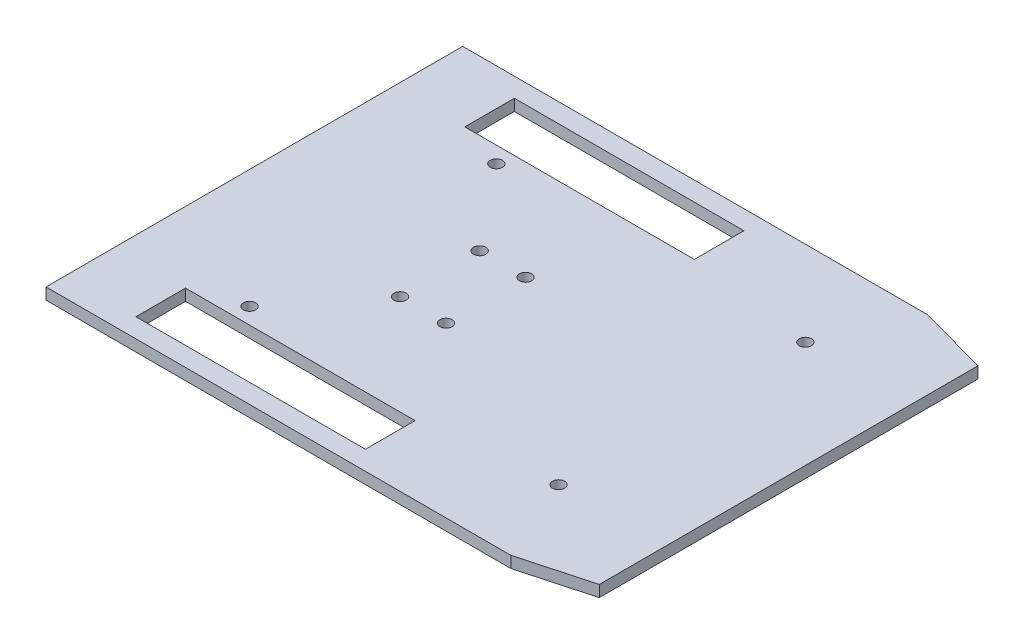
ISO-10303-21;
HEADER;
FILE_DESCRIPTION(('STEP AP214'),'2;1');
FILE_NAME('part.step','',(''),(''),'','','');
FILE_SCHEMA(('AUTOMOTIVE_DESIGN { 1 0 10303 214 1 1 1 1 }'));
ENDSEC;
DATA;
#1=APPLICATION_CONTEXT('core data for automotive mechanical design processes');
#2=APPLICATION_PROTOCOL_DEFINITION('international standard','automotive_design',2000,#1);
#3=PRODUCT_CONTEXT('',#1,'mechanical');
#4=PRODUCT('Part','Part','',(#3));
#5=PRODUCT_RELATED_PRODUCT_CATEGORY('part','',(#4));
#6=PRODUCT_DEFINITION_FORMATION('','',#4);
#7=PRODUCT_DEFINITION_CONTEXT('part definition',#1,'design');
#8=PRODUCT_DEFINITION('design','',#6,#7);
#9=PRODUCT_DEFINITION_SHAPE('','',#8);
#10=(LENGTH_UNIT() NAMED_UNIT(*) SI_UNIT(.MILLI.,.METRE.));
#11=(NAMED_UNIT(*) PLANE_ANGLE_UNIT() SI_UNIT($,.RADIAN.));
#12=(NAMED_UNIT(*) SI_UNIT($,.STERADIAN.) SOLID_ANGLE_UNIT());
#13=UNCERTAINTY_MEASURE_WITH_UNIT(LENGTH_MEASURE(1.E-05),#10,'distance_accuracy_value','');
#14=(GEOMETRIC_REPRESENTATION_CONTEXT(3) GLOBAL_UNCERTAINTY_ASSIGNED_CONTEXT((#13)) GLOBAL_UNIT_ASSIGNED_CONTEXT((#10,
#11,#12)) REPRESENTATION_CONTEXT('',''));
#15=CARTESIAN_POINT('',(0.,0.,0.));
#16=DIRECTION('',(0.,0.,1.));
#17=DIRECTION('',(1.,0.,0.));
#18=AXIS2_PLACEMENT_3D('',#15,#16,#17);
#19=CARTESIAN_POINT('',(0.,3.,0.));
#20=DIRECTION('',(0.,-1.,0.));
#21=DIRECTION('',(0.,0.,-1.));
#22=AXIS2_PLACEMENT_3D('',#19,#20,#21);
#23=PLANE('',#22);
#24=DIRECTION('',(1.,0.,0.));
#25=VECTOR('',#24,1.);
#26=CARTESIAN_POINT('',(9.99999999999999,3.,4.46609098685543));
#27=LINE('',#26,#25);
#28=CARTESIAN_POINT('',(9.99999999999999,3.,4.46609098685543));
#29=VERTEX_POINT('',#28);
#30=CARTESIAN_POINT('',(70.,3.,4.46609098685543));
#31=VERTEX_POINT('',#30);
#32=EDGE_CURVE('E159',#29,#31,#27,.T.);
#33=ORIENTED_EDGE('',*,*,#32,.F.);
#34=DIRECTION('',(0.,0.,-1.));
#35=VECTOR('',#34,1.);
#36=CARTESIAN_POINT('',(9.99999999999999,3.,0.));
#37=LINE('',#36,#35);
#38=CARTESIAN_POINT('',(9.99999999999999,3.,-8.50000000000003));
#39=VERTEX_POINT('',#38);
#40=EDGE_CURVE('E251',#29,#39,#37,.T.);
#41=ORIENTED_EDGE('',*,*,#40,.T.);
#42=DIRECTION('',(1.,0.,0.));
#43=VECTOR('',#42,1.);
#44=CARTESIAN_POINT('',(0.,3.,-8.50000000000004));
#45=LINE('',#44,#43);
#46=CARTESIAN_POINT('',(70.,3.,-8.50000000000001));
#47=VERTEX_POINT('',#46);
#48=EDGE_CURVE('E248',#39,#47,#45,.T.);
#49=ORIENTED_EDGE('',*,*,#48,.T.);
#50=DIRECTION('',(0.,0.,1.));
#51=VECTOR('',#50,1.);
#52=CARTESIAN_POINT('',(70.,3.,1.14287664299648E-13));
#53=LINE('',#52,#51);
#54=EDGE_CURVE('E254',#47,#31,#53,.T.);
#55=ORIENTED_EDGE('',*,*,#54,.T.);
#56=EDGE_LOOP('',(#33,#41,#49,#55));
#57=FACE_BOUND('',#56,.T.);
#58=CARTESIAN_POINT('',(103.27,3.,-77.26));
#59=DIRECTION('',(0.,1.,0.));
#60=DIRECTION('',(0.,0.,1.));
#61=AXIS2_PLACEMENT_3D('',#58,#59,#60);
#62=CIRCLE('',#61,1.60000000000001);
#63=CARTESIAN_POINT('',(103.27,3.,-75.66));
#64=VERTEX_POINT('',#63);
#65=EDGE_CURVE('E217',#64,#64,#62,.F.);
#66=ORIENTED_EDGE('',*,*,#65,.T.);
#67=EDGE_LOOP('',(#66));
#68=FACE_BOUND('',#67,.T.);
#69=CARTESIAN_POINT('',(22.5,3.,-12.74));
#70=DIRECTION('',(0.,1.,0.));
#71=DIRECTION('',(0.,0.,1.));
#72=AXIS2_PLACEMENT_3D('',#69,#70,#71);
#73=CIRCLE('',#72,1.6);
#74=CARTESIAN_POINT('',(22.5,3.,-11.14));
#75=VERTEX_POINT('',#74);
#76=EDGE_CURVE('E228',#75,#75,#73,.T.);
#77=ORIENTED_EDGE('',*,*,#76,.F.);
#78=EDGE_LOOP('',(#77));
#79=FACE_BOUND('',#78,.T.);
#80=CARTESIAN_POINT('',(22.5,3.,-77.26));
#81=DIRECTION('',(0.,1.,0.));
#82=DIRECTION('',(0.,0.,1.));
#83=AXIS2_PLACEMENT_3D('',#80,#81,#82);
#84=CIRCLE('',#83,1.60000000000001);
#85=CARTESIAN_POINT('',(22.5,3.,-75.66));
#86=VERTEX_POINT('',#85);
#87=EDGE_CURVE('E231',#86,#86,#84,.F.);
#88=ORIENTED_EDGE('',*,*,#87,.T.);
#89=EDGE_LOOP('',(#88));
#90=FACE_BOUND('',#89,.T.);
#91=CARTESIAN_POINT('',(40.,3.,-34.6));
#92=DIRECTION('',(0.,1.,0.));
#93=DIRECTION('',(0.,0.,1.));
#94=AXIS2_PLACEMENT_3D('',#91,#92,#93);
#95=CIRCLE('',#94,1.60000000000001);
#96=CARTESIAN_POINT('',(40.,3.,-33.));
#97=VERTEX_POINT('',#96);
#98=EDGE_CURVE('E243',#97,#97,#95,.F.);
#99=ORIENTED_EDGE('',*,*,#98,.T.);
#100=EDGE_LOOP('',(#99));
#101=FACE_BOUND('',#100,.T.);
#102=CARTESIAN_POINT('',(52.,3.,-34.6));
#103=DIRECTION('',(0.,1.,0.));
#104=DIRECTION('',(0.,0.,1.));
#105=AXIS2_PLACEMENT_3D('',#102,#103,#104);
#106=CIRCLE('',#105,1.60000000000001);
#107=CARTESIAN_POINT('',(52.,3.,-33.));
#108=VERTEX_POINT('',#107);
#109=EDGE_CURVE('E244',#108,#108,#106,.F.);
#110=ORIENTED_EDGE('',*,*,#109,.T.);
#111=EDGE_LOOP('',(#110));
#112=FACE_BOUND('',#111,.T.);
#113=CARTESIAN_POINT('',(40.,3.,-55.4));
#114=DIRECTION('',(0.,1.,0.));
#115=DIRECTION('',(0.,0.,1.));
#116=AXIS2_PLACEMENT_3D('',#113,#114,#115);
#117=CIRCLE('',#116,1.60000000000001);
#118=CARTESIAN_POINT('',(40.,3.,-53.8));
#119=VERTEX_POINT('',#118);
#120=EDGE_CURVE('E48',#119,#119,#117,.T.);
#121=ORIENTED_EDGE('',*,*,#120,.F.);
#122=EDGE_LOOP('',(#121));
#123=FACE_BOUND('',#122,.T.);
#124=CARTESIAN_POINT('',(52.,3.,-55.4));
#125=DIRECTION('',(0.,1.,0.));
#126=DIRECTION('',(0.,0.,1.));
#127=AXIS2_PLACEMENT_3D('',#124,#125,#126);
#128=CIRCLE('',#127,1.60000000000001);
#129=CARTESIAN_POINT('',(52.,3.,-53.8));
#130=VERTEX_POINT('',#129);
#131=EDGE_CURVE('E265',#130,#130,#128,.T.);
#132=ORIENTED_EDGE('',*,*,#131,.F.);
#133=EDGE_LOOP('',(#132));
#134=FACE_BOUND('',#133,.T.);
#135=DIRECTION('',(0.,0.,-1.));
#136=VECTOR('',#135,1.);
#137=CARTESIAN_POINT('',(9.99999999999998,3.,0.));
#138=LINE('',#137,#136);
#139=CARTESIAN_POINT('',(9.99999999999998,3.,-81.5));
#140=VERTEX_POINT('',#139);
#141=CARTESIAN_POINT('',(10.,3.,-94.4660909868555));
#142=VERTEX_POINT('',#141);
#143=EDGE_CURVE('E281',#140,#142,#138,.T.);
#144=ORIENTED_EDGE('',*,*,#143,.T.);
#145=DIRECTION('',(-1.,0.,0.));
#146=VECTOR('',#145,1.);
#147=CARTESIAN_POINT('',(10.,3.,-94.4660909868555));
#148=LINE('',#147,#146);
#149=CARTESIAN_POINT('',(70.,3.,-94.4660909868554));
#150=VERTEX_POINT('',#149);
#151=EDGE_CURVE('E165',#150,#142,#148,.T.);
#152=ORIENTED_EDGE('',*,*,#151,.F.);
#153=DIRECTION('',(0.,0.,-1.));
#154=VECTOR('',#153,1.);
#155=CARTESIAN_POINT('',(70.0000000000001,3.,-1.14287664299649E-13));
#156=LINE('',#155,#154);
#157=CARTESIAN_POINT('',(70.,3.,-81.5));
#158=VERTEX_POINT('',#157);
#159=EDGE_CURVE('E276',#158,#150,#156,.T.);
#160=ORIENTED_EDGE('',*,*,#159,.F.);
#161=DIRECTION('',(1.,0.,0.));
#162=VECTOR('',#161,1.);
#163=CARTESIAN_POINT('',(0.,3.,-81.5));
#164=LINE('',#163,#162);
#165=EDGE_CURVE('E283',#140,#158,#164,.T.);
#166=ORIENTED_EDGE('',*,*,#165,.F.);
#167=EDGE_LOOP('',(#144,#152,#160,#166));
#168=FACE_BOUND('',#167,.T.);
#169=CARTESIAN_POINT('',(103.27,3.,-12.74));
#170=DIRECTION('',(0.,1.,0.));
#171=DIRECTION('',(0.,0.,1.));
#172=AXIS2_PLACEMENT_3D('',#169,#170,#171);
#173=CIRCLE('',#172,1.6);
#174=CARTESIAN_POINT('',(103.27,3.,-11.14));
#175=VERTEX_POINT('',#174);
#176=EDGE_CURVE('E232',#175,#175,#173,.T.);
#177=ORIENTED_EDGE('',*,*,#176,.F.);
#178=EDGE_LOOP('',(#177));
#179=FACE_BOUND('',#178,.T.);
#180=DIRECTION('',(0.964602999889257,0.,-0.263706375737572));
#181=VECTOR('',#180,1.);
#182=CARTESIAN_POINT('',(131.16530317193,3.,4.5));
#183=LINE('',#182,#181);
#184=CARTESIAN_POINT('',(113.,3.,9.46609098685543));
#185=VERTEX_POINT('',#184);
#186=CARTESIAN_POINT('',(131.16530317193,3.,4.5));
#187=VERTEX_POINT('',#186);
#188=EDGE_CURVE('E176',#185,#187,#183,.T.);
#189=ORIENTED_EDGE('',*,*,#188,.T.);
#190=DIRECTION('',(0.,0.,-1.));
#191=VECTOR('',#190,1.);
#192=CARTESIAN_POINT('',(131.16530317193,3.,4.5));
#193=LINE('',#192,#191);
#194=CARTESIAN_POINT('',(131.16530317193,3.,-94.5));
#195=VERTEX_POINT('',#194);
#196=EDGE_CURVE('E201',#187,#195,#193,.T.);
#197=ORIENTED_EDGE('',*,*,#196,.T.);
#198=DIRECTION('',(-0.964602999889257,0.,-0.263706375737572));
#199=VECTOR('',#198,1.);
#200=CARTESIAN_POINT('',(131.16530317193,3.,-94.5));
#201=LINE('',#200,#199);
#202=CARTESIAN_POINT('',(113.,3.,-99.4660909868554));
#203=VERTEX_POINT('',#202);
#204=EDGE_CURVE('E204',#195,#203,#201,.T.);
#205=ORIENTED_EDGE('',*,*,#204,.T.);
#206=DIRECTION('',(-1.,0.,0.));
#207=VECTOR('',#206,1.);
#208=CARTESIAN_POINT('',(113.,3.,-99.4660909868554));
#209=LINE('',#208,#207);
#210=CARTESIAN_POINT('',(-8.50000000000006,3.,-99.4660909868554));
#211=VERTEX_POINT('',#210);
#212=EDGE_CURVE('E207',#203,#211,#209,.T.);
#213=ORIENTED_EDGE('',*,*,#212,.T.);
#214=DIRECTION('',(0.,0.,1.));
#215=VECTOR('',#214,1.);
#216=CARTESIAN_POINT('',(-8.50000000000006,3.,9.46609098685544));
#217=LINE('',#216,#215);
#218=CARTESIAN_POINT('',(-8.50000000000006,3.,9.46609098685544));
#219=VERTEX_POINT('',#218);
#220=EDGE_CURVE('E210',#211,#219,#217,.T.);
#221=ORIENTED_EDGE('',*,*,#220,.T.);
#222=DIRECTION('',(1.,0.,0.));
#223=VECTOR('',#222,1.);
#224=CARTESIAN_POINT('',(113.,3.,9.46609098685543));
#225=LINE('',#224,#223);
#226=EDGE_CURVE('E184',#219,#185,#225,.T.);
#227=ORIENTED_EDGE('',*,*,#226,.T.);
#228=EDGE_LOOP('',(#189,#197,#205,#213,#221,#227));
#229=FACE_BOUND('',#228,.T.);
#230=ADVANCED_FACE('F39',(#57,#68,#79,#90,#101,#112,#123,#134,#168,#179,#229),#23,.F.);
#231=CARTESIAN_POINT('',(0.,0.,0.));
#232=DIRECTION('',(0.,-1.,0.));
#233=DIRECTION('',(0.,0.,-1.));
#234=AXIS2_PLACEMENT_3D('',#231,#232,#233);
#235=PLANE('',#234);
#236=DIRECTION('',(0.,0.,-1.));
#237=VECTOR('',#236,1.);
#238=CARTESIAN_POINT('',(9.99999999999999,0.,0.));
#239=LINE('',#238,#237);
#240=CARTESIAN_POINT('',(9.99999999999999,0.,4.46609098685543));
#241=VERTEX_POINT('',#240);
#242=CARTESIAN_POINT('',(9.99999999999999,0.,-8.50000000000003));
#243=VERTEX_POINT('',#242);
#244=EDGE_CURVE('E150',#241,#243,#239,.T.);
#245=ORIENTED_EDGE('',*,*,#244,.F.);
#246=DIRECTION('',(1.,0.,0.));
#247=VECTOR('',#246,1.);
#248=CARTESIAN_POINT('',(9.99999999999999,0.,4.46609098685543));
#249=LINE('',#248,#247);
#250=CARTESIAN_POINT('',(70.,0.,4.46609098685543));
#251=VERTEX_POINT('',#250);
#252=EDGE_CURVE('E156',#241,#251,#249,.T.);
#253=ORIENTED_EDGE('',*,*,#252,.T.);
#254=DIRECTION('',(0.,0.,1.));
#255=VECTOR('',#254,1.);
#256=CARTESIAN_POINT('',(70.,0.,1.14287664299648E-13));
#257=LINE('',#256,#255);
#258=CARTESIAN_POINT('',(70.,0.,-8.50000000000001));
#259=VERTEX_POINT('',#258);
#260=EDGE_CURVE('E141',#259,#251,#257,.T.);
#261=ORIENTED_EDGE('',*,*,#260,.F.);
#262=DIRECTION('',(1.,0.,0.));
#263=VECTOR('',#262,1.);
#264=CARTESIAN_POINT('',(0.,0.,-8.50000000000004));
#265=LINE('',#264,#263);
#266=EDGE_CURVE('E149',#243,#259,#265,.T.);
#267=ORIENTED_EDGE('',*,*,#266,.F.);
#268=EDGE_LOOP('',(#245,#253,#261,#267));
#269=FACE_BOUND('',#268,.T.);
#270=CARTESIAN_POINT('',(103.27,0.,-77.26));
#271=DIRECTION('',(0.,-1.,0.));
#272=DIRECTION('',(0.,0.,-1.));
#273=AXIS2_PLACEMENT_3D('',#270,#271,#272);
#274=CIRCLE('',#273,1.60000000000001);
#275=CARTESIAN_POINT('',(103.27,0.,-78.86));
#276=VERTEX_POINT('',#275);
#277=EDGE_CURVE('E43',#276,#276,#274,.F.);
#278=ORIENTED_EDGE('',*,*,#277,.T.);
#279=EDGE_LOOP('',(#278));
#280=FACE_BOUND('',#279,.T.);
#281=CARTESIAN_POINT('',(22.5,0.,-77.26));
#282=DIRECTION('',(0.,-1.,0.));
#283=DIRECTION('',(0.,0.,-1.));
#284=AXIS2_PLACEMENT_3D('',#281,#282,#283);
#285=CIRCLE('',#284,1.60000000000001);
#286=CARTESIAN_POINT('',(22.5,0.,-78.86));
#287=VERTEX_POINT('',#286);
#288=EDGE_CURVE('E239',#287,#287,#285,.F.);
#289=ORIENTED_EDGE('',*,*,#288,.T.);
#290=EDGE_LOOP('',(#289));
#291=FACE_BOUND('',#290,.T.);
#292=CARTESIAN_POINT('',(52.,0.,-55.4));
#293=DIRECTION('',(0.,1.,0.));
#294=DIRECTION('',(0.,0.,1.));
#295=AXIS2_PLACEMENT_3D('',#292,#293,#294);
#296=CIRCLE('',#295,1.60000000000001);
#297=CARTESIAN_POINT('',(52.,0.,-53.8));
#298=VERTEX_POINT('',#297);
#299=EDGE_CURVE('E262',#298,#298,#296,.T.);
#300=ORIENTED_EDGE('',*,*,#299,.T.);
#301=EDGE_LOOP('',(#300));
#302=FACE_BOUND('',#301,.T.);
#303=CARTESIAN_POINT('',(52.,0.,-34.6));
#304=DIRECTION('',(0.,1.,0.));
#305=DIRECTION('',(0.,0.,1.));
#306=AXIS2_PLACEMENT_3D('',#303,#304,#305);
#307=CIRCLE('',#306,1.60000000000001);
#308=CARTESIAN_POINT('',(52.,0.,-33.));
#309=VERTEX_POINT('',#308);
#310=EDGE_CURVE('E240',#309,#309,#307,.F.);
#311=ORIENTED_EDGE('',*,*,#310,.F.);
#312=EDGE_LOOP('',(#311));
#313=FACE_BOUND('',#312,.T.);
#314=CARTESIAN_POINT('',(40.,0.,-55.4));
#315=DIRECTION('',(0.,1.,0.));
#316=DIRECTION('',(0.,0.,1.));
#317=AXIS2_PLACEMENT_3D('',#314,#315,#316);
#318=CIRCLE('',#317,1.60000000000001);
#319=CARTESIAN_POINT('',(40.,0.,-53.8));
#320=VERTEX_POINT('',#319);
#321=EDGE_CURVE('E11',#320,#320,#318,.T.);
#322=ORIENTED_EDGE('',*,*,#321,.T.);
#323=EDGE_LOOP('',(#322));
#324=FACE_BOUND('',#323,.T.);
#325=CARTESIAN_POINT('',(40.,0.,-34.6));
#326=DIRECTION('',(0.,1.,0.));
#327=DIRECTION('',(0.,0.,1.));
#328=AXIS2_PLACEMENT_3D('',#325,#326,#327);
#329=CIRCLE('',#328,1.60000000000001);
#330=CARTESIAN_POINT('',(40.,0.,-33.));
#331=VERTEX_POINT('',#330);
#332=EDGE_CURVE('E268',#331,#331,#329,.F.);
#333=ORIENTED_EDGE('',*,*,#332,.F.);
#334=EDGE_LOOP('',(#333));
#335=FACE_BOUND('',#334,.T.);
#336=DIRECTION('',(-1.,0.,0.));
#337=VECTOR('',#336,1.);
#338=CARTESIAN_POINT('',(10.,0.,-94.4660909868555));
#339=LINE('',#338,#337);
#340=CARTESIAN_POINT('',(70.,0.,-94.4660909868554));
#341=VERTEX_POINT('',#340);
#342=CARTESIAN_POINT('',(10.,0.,-94.4660909868555));
#343=VERTEX_POINT('',#342);
#344=EDGE_CURVE('E164',#341,#343,#339,.T.);
#345=ORIENTED_EDGE('',*,*,#344,.T.);
#346=DIRECTION('',(0.,0.,-1.));
#347=VECTOR('',#346,1.);
#348=CARTESIAN_POINT('',(9.99999999999998,0.,0.));
#349=LINE('',#348,#347);
#350=CARTESIAN_POINT('',(9.99999999999998,0.,-81.5));
#351=VERTEX_POINT('',#350);
#352=EDGE_CURVE('E273',#351,#343,#349,.T.);
#353=ORIENTED_EDGE('',*,*,#352,.F.);
#354=DIRECTION('',(1.,0.,0.));
#355=VECTOR('',#354,1.);
#356=CARTESIAN_POINT('',(0.,0.,-81.5));
#357=LINE('',#356,#355);
#358=CARTESIAN_POINT('',(70.,0.,-81.5));
#359=VERTEX_POINT('',#358);
#360=EDGE_CURVE('E275',#351,#359,#357,.T.);
#361=ORIENTED_EDGE('',*,*,#360,.T.);
#362=DIRECTION('',(0.,0.,-1.));
#363=VECTOR('',#362,1.);
#364=CARTESIAN_POINT('',(70.0000000000001,0.,-1.14287664299649E-13));
#365=LINE('',#364,#363);
#366=EDGE_CURVE('E56',#359,#341,#365,.T.);
#367=ORIENTED_EDGE('',*,*,#366,.T.);
#368=EDGE_LOOP('',(#345,#353,#361,#367));
#369=FACE_BOUND('',#368,.T.);
#370=CARTESIAN_POINT('',(22.5,0.,-12.74));
#371=DIRECTION('',(0.,-1.,0.));
#372=DIRECTION('',(0.,0.,-1.));
#373=AXIS2_PLACEMENT_3D('',#370,#371,#372);
#374=CIRCLE('',#373,1.6);
#375=CARTESIAN_POINT('',(22.5,0.,-14.34));
#376=VERTEX_POINT('',#375);
#377=EDGE_CURVE('E293',#376,#376,#374,.T.);
#378=ORIENTED_EDGE('',*,*,#377,.F.);
#379=EDGE_LOOP('',(#378));
#380=FACE_BOUND('',#379,.T.);
#381=CARTESIAN_POINT('',(103.27,0.,-12.74));
#382=DIRECTION('',(0.,-1.,0.));
#383=DIRECTION('',(0.,0.,-1.));
#384=AXIS2_PLACEMENT_3D('',#381,#382,#383);
#385=CIRCLE('',#384,1.6);
#386=CARTESIAN_POINT('',(103.27,0.,-14.34));
#387=VERTEX_POINT('',#386);
#388=EDGE_CURVE('E295',#387,#387,#385,.T.);
#389=ORIENTED_EDGE('',*,*,#388,.F.);
#390=EDGE_LOOP('',(#389));
#391=FACE_BOUND('',#390,.T.);
#392=DIRECTION('',(0.964602999889257,0.,-0.263706375737572));
#393=VECTOR('',#392,1.);
#394=CARTESIAN_POINT('',(131.16530317193,0.,4.5));
#395=LINE('',#394,#393);
#396=CARTESIAN_POINT('',(113.,0.,9.46609098685543));
#397=VERTEX_POINT('',#396);
#398=CARTESIAN_POINT('',(131.16530317193,0.,4.5));
#399=VERTEX_POINT('',#398);
#400=EDGE_CURVE('E180',#397,#399,#395,.T.);
#401=ORIENTED_EDGE('',*,*,#400,.F.);
#402=DIRECTION('',(1.,0.,0.));
#403=VECTOR('',#402,1.);
#404=CARTESIAN_POINT('',(113.,0.,9.46609098685543));
#405=LINE('',#404,#403);
#406=CARTESIAN_POINT('',(-8.50000000000006,0.,9.46609098685544));
#407=VERTEX_POINT('',#406);
#408=EDGE_CURVE('E195',#407,#397,#405,.T.);
#409=ORIENTED_EDGE('',*,*,#408,.F.);
#410=DIRECTION('',(0.,0.,1.));
#411=VECTOR('',#410,1.);
#412=CARTESIAN_POINT('',(-8.50000000000006,0.,-99.4660909868554));
#413=LINE('',#412,#411);
#414=CARTESIAN_POINT('',(-8.50000000000006,0.,-99.4660909868554));
#415=VERTEX_POINT('',#414);
#416=EDGE_CURVE('E193',#415,#407,#413,.T.);
#417=ORIENTED_EDGE('',*,*,#416,.F.);
#418=DIRECTION('',(-1.,0.,0.));
#419=VECTOR('',#418,1.);
#420=CARTESIAN_POINT('',(113.,0.,-99.4660909868554));
#421=LINE('',#420,#419);
#422=CARTESIAN_POINT('',(113.,0.,-99.4660909868554));
#423=VERTEX_POINT('',#422);
#424=EDGE_CURVE('E190',#423,#415,#421,.T.);
#425=ORIENTED_EDGE('',*,*,#424,.F.);
#426=DIRECTION('',(-0.964602999889257,0.,-0.263706375737572));
#427=VECTOR('',#426,1.);
#428=CARTESIAN_POINT('',(131.16530317193,0.,-94.5));
#429=LINE('',#428,#427);
#430=CARTESIAN_POINT('',(131.16530317193,0.,-94.5));
#431=VERTEX_POINT('',#430);
#432=EDGE_CURVE('E187',#431,#423,#429,.T.);
#433=ORIENTED_EDGE('',*,*,#432,.F.);
#434=DIRECTION('',(0.,0.,-1.));
#435=VECTOR('',#434,1.);
#436=CARTESIAN_POINT('',(131.16530317193,0.,4.5));
#437=LINE('',#436,#435);
#438=EDGE_CURVE('E183',#399,#431,#437,.T.);
#439=ORIENTED_EDGE('',*,*,#438,.F.);
#440=EDGE_LOOP('',(#401,#409,#417,#425,#433,#439));
#441=FACE_BOUND('',#440,.T.);
#442=ADVANCED_FACE('F41',(#269,#280,#291,#302,#313,#324,#335,#369,#380,#391,#441),#235,.T.);
#443=CARTESIAN_POINT('',(40.,0.,-55.4));
#444=DIRECTION('',(0.,1.,0.));
#445=DIRECTION('',(0.,0.,1.));
#446=AXIS2_PLACEMENT_3D('',#443,#444,#445);
#447=CYLINDRICAL_SURFACE('',#446,1.60000000000001);
#448=ORIENTED_EDGE('',*,*,#321,.F.);
#449=EDGE_LOOP('',(#448));
#450=FACE_BOUND('',#449,.T.);
#451=ORIENTED_EDGE('',*,*,#120,.T.);
#452=EDGE_LOOP('',(#451));
#453=FACE_BOUND('',#452,.T.);
#454=ADVANCED_FACE('F399',(#450,#453),#447,.F.);
#455=CARTESIAN_POINT('',(9.99999999999999,0.,0.));
#456=DIRECTION('',(1.,0.,0.));
#457=DIRECTION('',(0.,0.,-1.));
#458=AXIS2_PLACEMENT_3D('',#455,#456,#457);
#459=PLANE('',#458);
#460=ORIENTED_EDGE('',*,*,#40,.F.);
#461=DIRECTION('',(0.,1.,0.));
#462=VECTOR('',#461,1.);
#463=CARTESIAN_POINT('',(9.99999999999999,0.,4.46609098685543));
#464=LINE('',#463,#462);
#465=EDGE_CURVE('E161',#241,#29,#464,.T.);
#466=ORIENTED_EDGE('',*,*,#465,.F.);
#467=ORIENTED_EDGE('',*,*,#244,.T.);
#468=DIRECTION('',(0.,1.,0.));
#469=VECTOR('',#468,1.);
#470=CARTESIAN_POINT('',(9.99999999999999,0.,-8.50000000000003));
#471=LINE('',#470,#469);
#472=EDGE_CURVE('E247',#243,#39,#471,.T.);
#473=ORIENTED_EDGE('',*,*,#472,.T.);
#474=EDGE_LOOP('',(#460,#466,#467,#473));
#475=FACE_BOUND('',#474,.T.);
#476=ADVANCED_FACE('F393',(#475),#459,.T.);
#477=CARTESIAN_POINT('',(0.,0.,-8.50000000000004));
#478=DIRECTION('',(0.,0.,1.));
#479=DIRECTION('',(1.,0.,0.));
#480=AXIS2_PLACEMENT_3D('',#477,#478,#479);
#481=PLANE('',#480);
#482=ORIENTED_EDGE('',*,*,#48,.F.);
#483=ORIENTED_EDGE('',*,*,#472,.F.);
#484=ORIENTED_EDGE('',*,*,#266,.T.);
#485=DIRECTION('',(0.,1.,0.));
#486=VECTOR('',#485,1.);
#487=CARTESIAN_POINT('',(70.,0.,-8.50000000000001));
#488=LINE('',#487,#486);
#489=EDGE_CURVE('E64',#259,#47,#488,.T.);
#490=ORIENTED_EDGE('',*,*,#489,.T.);
#491=EDGE_LOOP('',(#482,#483,#484,#490));
#492=FACE_BOUND('',#491,.T.);
#493=ADVANCED_FACE('F390',(#492),#481,.T.);
#494=CARTESIAN_POINT('',(70.,0.,1.14287664299648E-13));
#495=DIRECTION('',(-1.,0.,0.));
#496=DIRECTION('',(0.,0.,1.));
#497=AXIS2_PLACEMENT_3D('',#494,#495,#496);
#498=PLANE('',#497);
#499=ORIENTED_EDGE('',*,*,#54,.F.);
#500=ORIENTED_EDGE('',*,*,#489,.F.);
#501=ORIENTED_EDGE('',*,*,#260,.T.);
#502=DIRECTION('',(0.,1.,0.));
#503=VECTOR('',#502,1.);
#504=CARTESIAN_POINT('',(70.,0.,4.46609098685543));
#505=LINE('',#504,#503);
#506=EDGE_CURVE('E144',#251,#31,#505,.T.);
#507=ORIENTED_EDGE('',*,*,#506,.T.);
#508=EDGE_LOOP('',(#499,#500,#501,#507));
#509=FACE_BOUND('',#508,.T.);
#510=ADVANCED_FACE('F143',(#509),#498,.T.);
#511=CARTESIAN_POINT('',(52.,0.,-34.6));
#512=DIRECTION('',(0.,1.,0.));
#513=DIRECTION('',(0.,0.,1.));
#514=AXIS2_PLACEMENT_3D('',#511,#512,#513);
#515=CYLINDRICAL_SURFACE('',#514,1.60000000000001);
#516=ORIENTED_EDGE('',*,*,#310,.T.);
#517=EDGE_LOOP('',(#516));
#518=FACE_BOUND('',#517,.T.);
#519=ORIENTED_EDGE('',*,*,#109,.F.);
#520=EDGE_LOOP('',(#519));
#521=FACE_BOUND('',#520,.T.);
#522=ADVANCED_FACE('F385',(#518,#521),#515,.F.);
#523=CARTESIAN_POINT('',(40.,0.,-34.6));
#524=DIRECTION('',(0.,1.,0.));
#525=DIRECTION('',(0.,0.,1.));
#526=AXIS2_PLACEMENT_3D('',#523,#524,#525);
#527=CYLINDRICAL_SURFACE('',#526,1.60000000000001);
#528=ORIENTED_EDGE('',*,*,#332,.T.);
#529=EDGE_LOOP('',(#528));
#530=FACE_BOUND('',#529,.T.);
#531=ORIENTED_EDGE('',*,*,#98,.F.);
#532=EDGE_LOOP('',(#531));
#533=FACE_BOUND('',#532,.T.);
#534=ADVANCED_FACE('F388',(#530,#533),#527,.F.);
#535=CARTESIAN_POINT('',(52.,0.,-55.4));
#536=DIRECTION('',(0.,1.,0.));
#537=DIRECTION('',(0.,0.,1.));
#538=AXIS2_PLACEMENT_3D('',#535,#536,#537);
#539=CYLINDRICAL_SURFACE('',#538,1.60000000000001);
#540=ORIENTED_EDGE('',*,*,#299,.F.);
#541=EDGE_LOOP('',(#540));
#542=FACE_BOUND('',#541,.T.);
#543=ORIENTED_EDGE('',*,*,#131,.T.);
#544=EDGE_LOOP('',(#543));
#545=FACE_BOUND('',#544,.T.);
#546=ADVANCED_FACE('F401',(#542,#545),#539,.F.);
#547=CARTESIAN_POINT('',(9.99999999999998,0.,0.));
#548=DIRECTION('',(1.,0.,0.));
#549=DIRECTION('',(0.,0.,-1.));
#550=AXIS2_PLACEMENT_3D('',#547,#548,#549);
#551=PLANE('',#550);
#552=ORIENTED_EDGE('',*,*,#143,.F.);
#553=DIRECTION('',(0.,1.,0.));
#554=VECTOR('',#553,1.);
#555=CARTESIAN_POINT('',(9.99999999999998,0.,-81.5));
#556=LINE('',#555,#554);
#557=EDGE_CURVE('E280',#351,#140,#556,.T.);
#558=ORIENTED_EDGE('',*,*,#557,.F.);
#559=ORIENTED_EDGE('',*,*,#352,.T.);
#560=DIRECTION('',(0.,1.,0.));
#561=VECTOR('',#560,1.);
#562=CARTESIAN_POINT('',(10.,0.,-94.4660909868555));
#563=LINE('',#562,#561);
#564=EDGE_CURVE('E173',#343,#142,#563,.T.);
#565=ORIENTED_EDGE('',*,*,#564,.T.);
#566=EDGE_LOOP('',(#552,#558,#559,#565));
#567=FACE_BOUND('',#566,.T.);
#568=ADVANCED_FACE('F404',(#567),#551,.T.);
#569=CARTESIAN_POINT('',(70.0000000000001,0.,-1.14287664299649E-13));
#570=DIRECTION('',(1.,0.,0.));
#571=DIRECTION('',(0.,0.,-1.));
#572=AXIS2_PLACEMENT_3D('',#569,#570,#571);
#573=PLANE('',#572);
#574=ORIENTED_EDGE('',*,*,#159,.T.);
#575=DIRECTION('',(0.,1.,0.));
#576=VECTOR('',#575,1.);
#577=CARTESIAN_POINT('',(70.,0.,-94.4660909868554));
#578=LINE('',#577,#576);
#579=EDGE_CURVE('E160',#341,#150,#578,.T.);
#580=ORIENTED_EDGE('',*,*,#579,.F.);
#581=ORIENTED_EDGE('',*,*,#366,.F.);
#582=DIRECTION('',(0.,1.,0.));
#583=VECTOR('',#582,1.);
#584=CARTESIAN_POINT('',(70.,0.,-81.5));
#585=LINE('',#584,#583);
#586=EDGE_CURVE('E255',#359,#158,#585,.T.);
#587=ORIENTED_EDGE('',*,*,#586,.T.);
#588=EDGE_LOOP('',(#574,#580,#581,#587));
#589=FACE_BOUND('',#588,.T.);
#590=ADVANCED_FACE('F409',(#589),#573,.F.);
#591=CARTESIAN_POINT('',(0.,0.,-81.5));
#592=DIRECTION('',(0.,0.,1.));
#593=DIRECTION('',(1.,0.,0.));
#594=AXIS2_PLACEMENT_3D('',#591,#592,#593);
#595=PLANE('',#594);
#596=ORIENTED_EDGE('',*,*,#165,.T.);
#597=ORIENTED_EDGE('',*,*,#586,.F.);
#598=ORIENTED_EDGE('',*,*,#360,.F.);
#599=ORIENTED_EDGE('',*,*,#557,.T.);
#600=EDGE_LOOP('',(#596,#597,#598,#599));
#601=FACE_BOUND('',#600,.T.);
#602=ADVANCED_FACE('F383',(#601),#595,.F.);
#603=CARTESIAN_POINT('',(22.5,-7.,-77.26));
#604=DIRECTION('',(0.,1.,0.));
#605=DIRECTION('',(0.,0.,1.));
#606=AXIS2_PLACEMENT_3D('',#603,#604,#605);
#607=CYLINDRICAL_SURFACE('',#606,1.60000000000001);
#608=ORIENTED_EDGE('',*,*,#288,.F.);
#609=EDGE_LOOP('',(#608));
#610=FACE_BOUND('',#609,.T.);
#611=ORIENTED_EDGE('',*,*,#87,.F.);
#612=EDGE_LOOP('',(#611));
#613=FACE_BOUND('',#612,.T.);
#614=ADVANCED_FACE('F377',(#610,#613),#607,.F.);
#615=CARTESIAN_POINT('',(22.5,-7.,-12.74));
#616=DIRECTION('',(0.,1.,0.));
#617=DIRECTION('',(0.,0.,1.));
#618=AXIS2_PLACEMENT_3D('',#615,#616,#617);
#619=CYLINDRICAL_SURFACE('',#618,1.6);
#620=ORIENTED_EDGE('',*,*,#377,.T.);
#621=EDGE_LOOP('',(#620));
#622=FACE_BOUND('',#621,.T.);
#623=ORIENTED_EDGE('',*,*,#76,.T.);
#624=EDGE_LOOP('',(#623));
#625=FACE_BOUND('',#624,.T.);
#626=ADVANCED_FACE('F374',(#622,#625),#619,.F.);
#627=CARTESIAN_POINT('',(103.27,-7.,-12.74));
#628=DIRECTION('',(0.,1.,0.));
#629=DIRECTION('',(0.,0.,1.));
#630=AXIS2_PLACEMENT_3D('',#627,#628,#629);
#631=CYLINDRICAL_SURFACE('',#630,1.6);
#632=ORIENTED_EDGE('',*,*,#388,.T.);
#633=EDGE_LOOP('',(#632));
#634=FACE_BOUND('',#633,.T.);
#635=ORIENTED_EDGE('',*,*,#176,.T.);
#636=EDGE_LOOP('',(#635));
#637=FACE_BOUND('',#636,.T.);
#638=ADVANCED_FACE('F307',(#634,#637),#631,.F.);
#639=CARTESIAN_POINT('',(103.27,-7.,-77.26));
#640=DIRECTION('',(0.,1.,0.));
#641=DIRECTION('',(0.,0.,1.));
#642=AXIS2_PLACEMENT_3D('',#639,#640,#641);
#643=CYLINDRICAL_SURFACE('',#642,1.60000000000001);
#644=ORIENTED_EDGE('',*,*,#277,.F.);
#645=EDGE_LOOP('',(#644));
#646=FACE_BOUND('',#645,.T.);
#647=ORIENTED_EDGE('',*,*,#65,.F.);
#648=EDGE_LOOP('',(#647));
#649=FACE_BOUND('',#648,.T.);
#650=ADVANCED_FACE('F303',(#646,#649),#643,.F.);
#651=CARTESIAN_POINT('',(131.16530317193,0.,4.5));
#652=DIRECTION('',(0.263706375737572,0.,0.964602999889257));
#653=DIRECTION('',(0.964602999889257,0.,-0.263706375737572));
#654=AXIS2_PLACEMENT_3D('',#651,#652,#653);
#655=PLANE('',#654);
#656=ORIENTED_EDGE('',*,*,#188,.F.);
#657=DIRECTION('',(0.,1.,0.));
#658=VECTOR('',#657,1.);
#659=CARTESIAN_POINT('',(113.,0.,9.46609098685543));
#660=LINE('',#659,#658);
#661=EDGE_CURVE('E215',#397,#185,#660,.T.);
#662=ORIENTED_EDGE('',*,*,#661,.F.);
#663=ORIENTED_EDGE('',*,*,#400,.T.);
#664=DIRECTION('',(0.,1.,0.));
#665=VECTOR('',#664,1.);
#666=CARTESIAN_POINT('',(131.16530317193,0.,4.5));
#667=LINE('',#666,#665);
#668=EDGE_CURVE('E198',#399,#187,#667,.T.);
#669=ORIENTED_EDGE('',*,*,#668,.T.);
#670=EDGE_LOOP('',(#656,#662,#663,#669));
#671=FACE_BOUND('',#670,.T.);
#672=ADVANCED_FACE('F306',(#671),#655,.T.);
#673=CARTESIAN_POINT('',(113.,0.,9.46609098685543));
#674=DIRECTION('',(0.,0.,1.));
#675=DIRECTION('',(1.,0.,0.));
#676=AXIS2_PLACEMENT_3D('',#673,#674,#675);
#677=PLANE('',#676);
#678=ORIENTED_EDGE('',*,*,#226,.F.);
#679=DIRECTION('',(0.,1.,0.));
#680=VECTOR('',#679,1.);
#681=CARTESIAN_POINT('',(-8.50000000000006,0.,9.46609098685544));
#682=LINE('',#681,#680);
#683=EDGE_CURVE('E218',#407,#219,#682,.T.);
#684=ORIENTED_EDGE('',*,*,#683,.F.);
#685=ORIENTED_EDGE('',*,*,#408,.T.);
#686=ORIENTED_EDGE('',*,*,#661,.T.);
#687=EDGE_LOOP('',(#678,#684,#685,#686));
#688=FACE_BOUND('',#687,.T.);
#689=ADVANCED_FACE('F355',(#688),#677,.T.);
#690=CARTESIAN_POINT('',(-8.50000000000006,0.,9.46609098685544));
#691=DIRECTION('',(-1.,0.,0.));
#692=DIRECTION('',(0.,0.,1.));
#693=AXIS2_PLACEMENT_3D('',#690,#691,#692);
#694=PLANE('',#693);
#695=ORIENTED_EDGE('',*,*,#220,.F.);
#696=DIRECTION('',(0.,1.,0.));
#697=VECTOR('',#696,1.);
#698=CARTESIAN_POINT('',(-8.50000000000006,0.,-99.4660909868554));
#699=LINE('',#698,#697);
#700=EDGE_CURVE('E220',#415,#211,#699,.T.);
#701=ORIENTED_EDGE('',*,*,#700,.F.);
#702=ORIENTED_EDGE('',*,*,#416,.T.);
#703=ORIENTED_EDGE('',*,*,#683,.T.);
#704=EDGE_LOOP('',(#695,#701,#702,#703));
#705=FACE_BOUND('',#704,.T.);
#706=ADVANCED_FACE('F350',(#705),#694,.T.);
#707=CARTESIAN_POINT('',(113.,0.,-99.4660909868554));
#708=DIRECTION('',(0.,0.,-1.));
#709=DIRECTION('',(-1.,0.,0.));
#710=AXIS2_PLACEMENT_3D('',#707,#708,#709);
#711=PLANE('',#710);
#712=ORIENTED_EDGE('',*,*,#212,.F.);
#713=DIRECTION('',(0.,1.,0.));
#714=VECTOR('',#713,1.);
#715=CARTESIAN_POINT('',(113.,0.,-99.4660909868554));
#716=LINE('',#715,#714);
#717=EDGE_CURVE('E223',#423,#203,#716,.T.);
#718=ORIENTED_EDGE('',*,*,#717,.F.);
#719=ORIENTED_EDGE('',*,*,#424,.T.);
#720=ORIENTED_EDGE('',*,*,#700,.T.);
#721=EDGE_LOOP('',(#712,#718,#719,#720));
#722=FACE_BOUND('',#721,.T.);
#723=ADVANCED_FACE('F346',(#722),#711,.T.);
#724=CARTESIAN_POINT('',(131.16530317193,0.,-94.5));
#725=DIRECTION('',(0.263706375737572,0.,-0.964602999889257));
#726=DIRECTION('',(-0.964602999889257,0.,-0.263706375737572));
#727=AXIS2_PLACEMENT_3D('',#724,#725,#726);
#728=PLANE('',#727);
#729=ORIENTED_EDGE('',*,*,#204,.F.);
#730=DIRECTION('',(0.,1.,0.));
#731=VECTOR('',#730,1.);
#732=CARTESIAN_POINT('',(131.16530317193,0.,-94.5));
#733=LINE('',#732,#731);
#734=EDGE_CURVE('E225',#431,#195,#733,.T.);
#735=ORIENTED_EDGE('',*,*,#734,.F.);
#736=ORIENTED_EDGE('',*,*,#432,.T.);
#737=ORIENTED_EDGE('',*,*,#717,.T.);
#738=EDGE_LOOP('',(#729,#735,#736,#737));
#739=FACE_BOUND('',#738,.T.);
#740=ADVANCED_FACE('F343',(#739),#728,.T.);
#741=CARTESIAN_POINT('',(131.16530317193,0.,4.5));
#742=DIRECTION('',(1.,0.,0.));
#743=DIRECTION('',(0.,0.,-1.));
#744=AXIS2_PLACEMENT_3D('',#741,#742,#743);
#745=PLANE('',#744);
#746=ORIENTED_EDGE('',*,*,#196,.F.);
#747=ORIENTED_EDGE('',*,*,#668,.F.);
#748=ORIENTED_EDGE('',*,*,#438,.T.);
#749=ORIENTED_EDGE('',*,*,#734,.T.);
#750=EDGE_LOOP('',(#746,#747,#748,#749));
#751=FACE_BOUND('',#750,.T.);
#752=ADVANCED_FACE('F339',(#751),#745,.T.);
#753=CARTESIAN_POINT('',(10.,0.,-94.4660909868555));
#754=DIRECTION('',(0.,0.,-1.));
#755=DIRECTION('',(-1.,0.,0.));
#756=AXIS2_PLACEMENT_3D('',#753,#754,#755);
#757=PLANE('',#756);
#758=ORIENTED_EDGE('',*,*,#151,.T.);
#759=ORIENTED_EDGE('',*,*,#564,.F.);
#760=ORIENTED_EDGE('',*,*,#344,.F.);
#761=ORIENTED_EDGE('',*,*,#579,.T.);
#762=EDGE_LOOP('',(#758,#759,#760,#761));
#763=FACE_BOUND('',#762,.T.);
#764=ADVANCED_FACE('F372',(#763),#757,.F.);
#765=CARTESIAN_POINT('',(9.99999999999999,0.,4.46609098685543));
#766=DIRECTION('',(0.,0.,1.));
#767=DIRECTION('',(1.,0.,0.));
#768=AXIS2_PLACEMENT_3D('',#765,#766,#767);
#769=PLANE('',#768);
#770=ORIENTED_EDGE('',*,*,#32,.T.);
#771=ORIENTED_EDGE('',*,*,#506,.F.);
#772=ORIENTED_EDGE('',*,*,#252,.F.);
#773=ORIENTED_EDGE('',*,*,#465,.T.);
#774=EDGE_LOOP('',(#770,#771,#772,#773));
#775=FACE_BOUND('',#774,.T.);
#776=ADVANCED_FACE('F154',(#775),#769,.F.);
#777=CLOSED_SHELL('',(#230,#442,#454,#476,#493,#510,#522,#534,#546,#568,#590,#602,#614,#626,
#638,#650,#672,#689,#706,#723,#740,#752,#764,#776));
#778=MANIFOLD_SOLID_BREP('B2',#777);
#779=ADVANCED_BREP_SHAPE_REPRESENTATION('',(#18,#778),#14);
#780=SHAPE_DEFINITION_REPRESENTATION(#9,#779);
ENDSEC;
END-ISO-10303-21;
